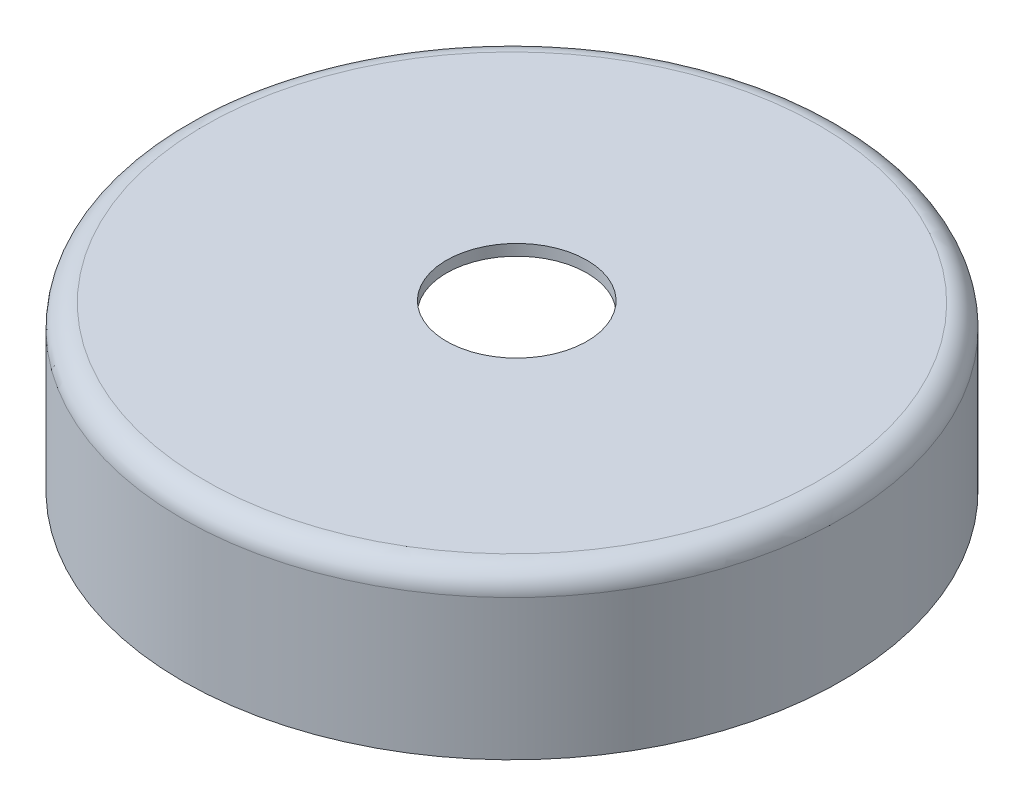
ISO-10303-21;
HEADER;
FILE_DESCRIPTION(('STEP AP214'),'2;1');
FILE_NAME('part.step','',(''),(''),'','','');
FILE_SCHEMA(('AUTOMOTIVE_DESIGN { 1 0 10303 214 1 1 1 1 }'));
ENDSEC;
DATA;
#1=APPLICATION_CONTEXT('core data for automotive mechanical design processes');
#2=APPLICATION_PROTOCOL_DEFINITION('international standard','automotive_design',2000,#1);
#3=PRODUCT_CONTEXT('',#1,'mechanical');
#4=PRODUCT('Part','Part','',(#3));
#5=PRODUCT_RELATED_PRODUCT_CATEGORY('part','',(#4));
#6=PRODUCT_DEFINITION_FORMATION('','',#4);
#7=PRODUCT_DEFINITION_CONTEXT('part definition',#1,'design');
#8=PRODUCT_DEFINITION('design','',#6,#7);
#9=PRODUCT_DEFINITION_SHAPE('','',#8);
#10=(LENGTH_UNIT() NAMED_UNIT(*) SI_UNIT(.MILLI.,.METRE.));
#11=(NAMED_UNIT(*) PLANE_ANGLE_UNIT() SI_UNIT($,.RADIAN.));
#12=(NAMED_UNIT(*) SI_UNIT($,.STERADIAN.) SOLID_ANGLE_UNIT());
#13=UNCERTAINTY_MEASURE_WITH_UNIT(LENGTH_MEASURE(1.E-05),#10,'distance_accuracy_value','');
#14=(GEOMETRIC_REPRESENTATION_CONTEXT(3) GLOBAL_UNCERTAINTY_ASSIGNED_CONTEXT((#13)) GLOBAL_UNIT_ASSIGNED_CONTEXT((#10,
#11,#12)) REPRESENTATION_CONTEXT('',''));
#15=CARTESIAN_POINT('',(0.,0.,0.));
#16=DIRECTION('',(0.,0.,1.));
#17=DIRECTION('',(1.,0.,0.));
#18=AXIS2_PLACEMENT_3D('',#15,#16,#17);
#19=CARTESIAN_POINT('',(0.,0.,0.));
#20=DIRECTION('',(0.,1.,0.));
#21=DIRECTION('',(0.,0.,1.));
#22=AXIS2_PLACEMENT_3D('',#19,#20,#21);
#23=PLANE('',#22);
#24=CARTESIAN_POINT('',(0.,0.,0.));
#25=DIRECTION('',(0.,-1.,0.));
#26=DIRECTION('',(0.,0.,-1.));
#27=AXIS2_PLACEMENT_3D('',#24,#25,#26);
#28=CIRCLE('',#27,141.4859375);
#29=CARTESIAN_POINT('',(0.,0.,-141.4859375));
#30=VERTEX_POINT('',#29);
#31=EDGE_CURVE('E56',#30,#30,#28,.T.);
#32=ORIENTED_EDGE('',*,*,#31,.T.);
#33=EDGE_LOOP('',(#32));
#34=FACE_BOUND('',#33,.T.);
#35=CARTESIAN_POINT('',(0.,0.,0.));
#36=DIRECTION('',(0.,1.,0.));
#37=DIRECTION('',(0.,0.,1.));
#38=AXIS2_PLACEMENT_3D('',#35,#36,#37);
#39=CIRCLE('',#38,136.7234375);
#40=CARTESIAN_POINT('',(0.,0.,136.7234375));
#41=VERTEX_POINT('',#40);
#42=EDGE_CURVE('E62',#41,#41,#39,.F.);
#43=ORIENTED_EDGE('',*,*,#42,.F.);
#44=EDGE_LOOP('',(#43));
#45=FACE_BOUND('',#44,.T.);
#46=ADVANCED_FACE('F44',(#34,#45),#23,.F.);
#47=CARTESIAN_POINT('',(0.,0.,0.));
#48=DIRECTION('',(0.,-1.,0.));
#49=DIRECTION('',(0.,0.,-1.));
#50=AXIS2_PLACEMENT_3D('',#47,#48,#49);
#51=CYLINDRICAL_SURFACE('',#50,141.4859375);
#52=CARTESIAN_POINT('',(0.,60.325,0.));
#53=DIRECTION('',(0.,-1.,0.));
#54=DIRECTION('',(0.,0.,-1.));
#55=AXIS2_PLACEMENT_3D('',#52,#53,#54);
#56=CIRCLE('',#55,141.4859375);
#57=CARTESIAN_POINT('',(0.,60.325,-141.4859375));
#58=VERTEX_POINT('',#57);
#59=EDGE_CURVE('E52',#58,#58,#56,.T.);
#60=ORIENTED_EDGE('',*,*,#59,.T.);
#61=EDGE_LOOP('',(#60));
#62=FACE_BOUND('',#61,.T.);
#63=ORIENTED_EDGE('',*,*,#31,.F.);
#64=EDGE_LOOP('',(#63));
#65=FACE_BOUND('',#64,.T.);
#66=ADVANCED_FACE('F91',(#62,#65),#51,.T.);
#67=CARTESIAN_POINT('',(0.,69.85,141.4859375));
#68=DIRECTION('',(0.,-1.,0.));
#69=DIRECTION('',(0.,0.,-1.));
#70=AXIS2_PLACEMENT_3D('',#67,#68,#69);
#71=PLANE('',#70);
#72=CARTESIAN_POINT('',(0.218944765653387,69.85,-1.8106550324082));
#73=DIRECTION('',(0.,-1.,0.));
#74=DIRECTION('',(0.,0.,-1.));
#75=AXIS2_PLACEMENT_3D('',#72,#73,#74);
#76=CIRCLE('',#75,30.1625);
#77=CARTESIAN_POINT('',(0.218944765653387,69.85,-31.9731550324082));
#78=VERTEX_POINT('',#77);
#79=EDGE_CURVE('E66',#78,#78,#76,.F.);
#80=ORIENTED_EDGE('',*,*,#79,.F.);
#81=EDGE_LOOP('',(#80));
#82=FACE_BOUND('',#81,.T.);
#83=CARTESIAN_POINT('',(0.,69.85,0.));
#84=DIRECTION('',(0.,-1.,0.));
#85=DIRECTION('',(0.,0.,-1.));
#86=AXIS2_PLACEMENT_3D('',#83,#84,#85);
#87=CIRCLE('',#86,131.9609375);
#88=CARTESIAN_POINT('',(0.,69.85,-131.9609375));
#89=VERTEX_POINT('',#88);
#90=EDGE_CURVE('E12',#89,#89,#87,.F.);
#91=ORIENTED_EDGE('',*,*,#90,.T.);
#92=EDGE_LOOP('',(#91));
#93=FACE_BOUND('',#92,.T.);
#94=ADVANCED_FACE('F96',(#82,#93),#71,.F.);
#95=CARTESIAN_POINT('',(0.,60.325,0.));
#96=DIRECTION('',(0.,-1.,0.));
#97=DIRECTION('',(0.,0.,-1.));
#98=AXIS2_PLACEMENT_3D('',#95,#96,#97);
#99=TOROIDAL_SURFACE('',#98,131.9609375,9.525);
#100=ORIENTED_EDGE('',*,*,#90,.F.);
#101=EDGE_LOOP('',(#100));
#102=FACE_BOUND('',#101,.T.);
#103=ORIENTED_EDGE('',*,*,#59,.F.);
#104=EDGE_LOOP('',(#103));
#105=FACE_BOUND('',#104,.T.);
#106=ADVANCED_FACE('F46',(#102,#105),#99,.T.);
#107=CARTESIAN_POINT('',(0.,0.,0.));
#108=DIRECTION('',(0.,-1.,0.));
#109=DIRECTION('',(0.,0.,-1.));
#110=AXIS2_PLACEMENT_3D('',#107,#108,#109);
#111=CYLINDRICAL_SURFACE('',#110,136.7234375);
#112=CARTESIAN_POINT('',(0.,60.325,0.));
#113=DIRECTION('',(0.,-1.,0.));
#114=DIRECTION('',(0.,0.,-1.));
#115=AXIS2_PLACEMENT_3D('',#112,#113,#114);
#116=CIRCLE('',#115,136.7234375);
#117=CARTESIAN_POINT('',(0.,60.325,-136.7234375));
#118=VERTEX_POINT('',#117);
#119=EDGE_CURVE('E65',#118,#118,#116,.T.);
#120=ORIENTED_EDGE('',*,*,#119,.F.);
#121=EDGE_LOOP('',(#120));
#122=FACE_BOUND('',#121,.T.);
#123=ORIENTED_EDGE('',*,*,#42,.T.);
#124=EDGE_LOOP('',(#123));
#125=FACE_BOUND('',#124,.T.);
#126=ADVANCED_FACE('F105',(#122,#125),#111,.F.);
#127=CARTESIAN_POINT('',(0.,65.0875,141.4859375));
#128=DIRECTION('',(0.,-1.,0.));
#129=DIRECTION('',(0.,0.,-1.));
#130=AXIS2_PLACEMENT_3D('',#127,#128,#129);
#131=PLANE('',#130);
#132=CARTESIAN_POINT('',(0.218944765653387,65.0875,-1.8106550324082));
#133=DIRECTION('',(0.,-1.,0.));
#134=DIRECTION('',(0.,0.,-1.));
#135=AXIS2_PLACEMENT_3D('',#132,#133,#134);
#136=CIRCLE('',#135,30.1625);
#137=CARTESIAN_POINT('',(0.218944765653387,65.0875,-31.9731550324082));
#138=VERTEX_POINT('',#137);
#139=EDGE_CURVE('E48',#138,#138,#136,.F.);
#140=ORIENTED_EDGE('',*,*,#139,.T.);
#141=EDGE_LOOP('',(#140));
#142=FACE_BOUND('',#141,.T.);
#143=CARTESIAN_POINT('',(0.,65.0875,0.));
#144=DIRECTION('',(0.,-1.,0.));
#145=DIRECTION('',(0.,0.,-1.));
#146=AXIS2_PLACEMENT_3D('',#143,#144,#145);
#147=CIRCLE('',#146,131.9609375);
#148=CARTESIAN_POINT('',(0.,65.0875,-131.9609375));
#149=VERTEX_POINT('',#148);
#150=EDGE_CURVE('E61',#149,#149,#147,.F.);
#151=ORIENTED_EDGE('',*,*,#150,.F.);
#152=EDGE_LOOP('',(#151));
#153=FACE_BOUND('',#152,.T.);
#154=ADVANCED_FACE('F77',(#142,#153),#131,.T.);
#155=CARTESIAN_POINT('',(0.,60.325,0.));
#156=DIRECTION('',(0.,-1.,0.));
#157=DIRECTION('',(0.,0.,-1.));
#158=AXIS2_PLACEMENT_3D('',#155,#156,#157);
#159=TOROIDAL_SURFACE('',#158,131.9609375,4.7625);
#160=ORIENTED_EDGE('',*,*,#150,.T.);
#161=EDGE_LOOP('',(#160));
#162=FACE_BOUND('',#161,.T.);
#163=ORIENTED_EDGE('',*,*,#119,.T.);
#164=EDGE_LOOP('',(#163));
#165=FACE_BOUND('',#164,.T.);
#166=ADVANCED_FACE('F82',(#162,#165),#159,.F.);
#167=CARTESIAN_POINT('',(0.218944765653387,100.584,-1.8106550324082));
#168=DIRECTION('',(0.,-1.,0.));
#169=DIRECTION('',(0.,0.,-1.));
#170=AXIS2_PLACEMENT_3D('',#167,#168,#169);
#171=CYLINDRICAL_SURFACE('',#170,30.1625);
#172=ORIENTED_EDGE('',*,*,#139,.F.);
#173=EDGE_LOOP('',(#172));
#174=FACE_BOUND('',#173,.T.);
#175=ORIENTED_EDGE('',*,*,#79,.T.);
#176=EDGE_LOOP('',(#175));
#177=FACE_BOUND('',#176,.T.);
#178=ADVANCED_FACE('F80',(#174,#177),#171,.F.);
#179=CLOSED_SHELL('',(#46,#66,#94,#106,#126,#154,#166,#178));
#180=MANIFOLD_SOLID_BREP('B2',#179);
#181=ADVANCED_BREP_SHAPE_REPRESENTATION('',(#18,#180),#14);
#182=SHAPE_DEFINITION_REPRESENTATION(#9,#181);
ENDSEC;
END-ISO-10303-21;
